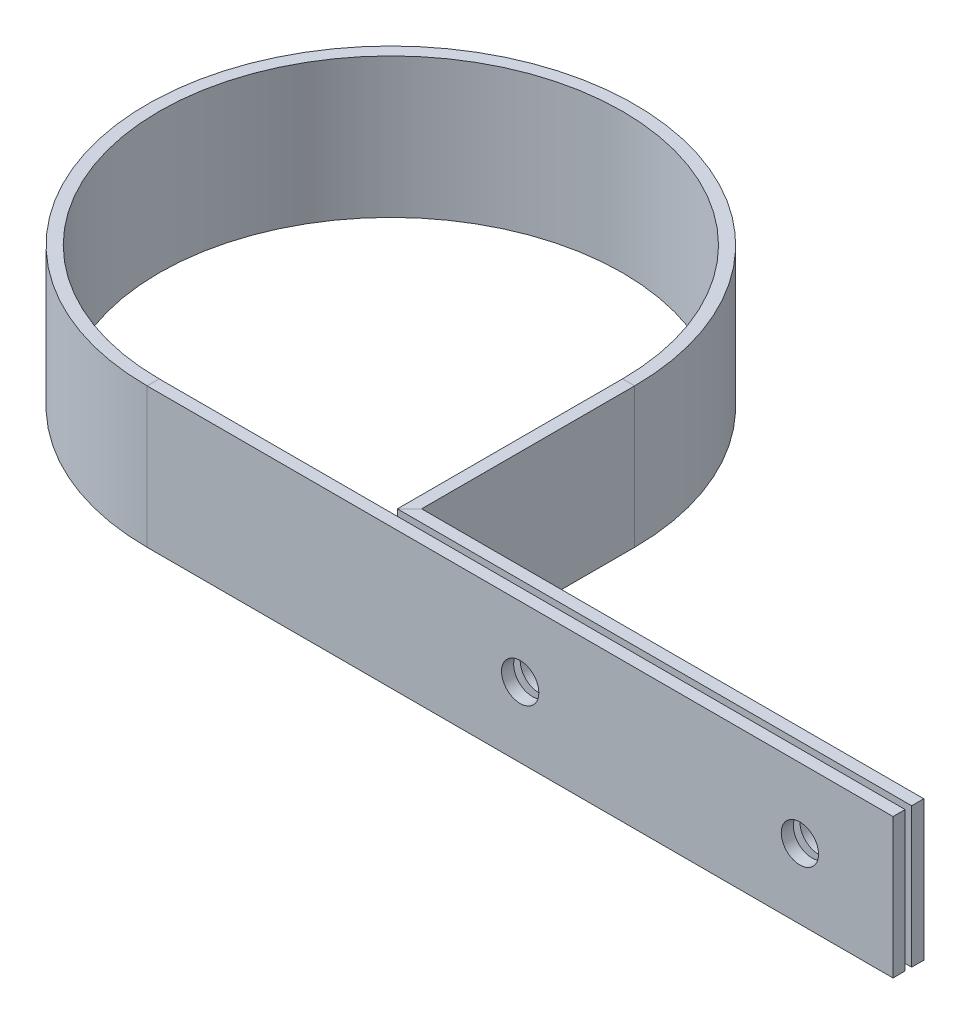
ISO-10303-21;
HEADER;
FILE_DESCRIPTION(('STEP AP214'),'2;1');
FILE_NAME('part.step','',(''),(''),'','','');
FILE_SCHEMA(('AUTOMOTIVE_DESIGN { 1 0 10303 214 1 1 1 1 }'));
ENDSEC;
DATA;
#1=APPLICATION_CONTEXT('core data for automotive mechanical design processes');
#2=APPLICATION_PROTOCOL_DEFINITION('international standard','automotive_design',2000,#1);
#3=PRODUCT_CONTEXT('',#1,'mechanical');
#4=PRODUCT('Part','Part','',(#3));
#5=PRODUCT_RELATED_PRODUCT_CATEGORY('part','',(#4));
#6=PRODUCT_DEFINITION_FORMATION('','',#4);
#7=PRODUCT_DEFINITION_CONTEXT('part definition',#1,'design');
#8=PRODUCT_DEFINITION('design','',#6,#7);
#9=PRODUCT_DEFINITION_SHAPE('','',#8);
#10=(LENGTH_UNIT() NAMED_UNIT(*) SI_UNIT(.MILLI.,.METRE.));
#11=(NAMED_UNIT(*) PLANE_ANGLE_UNIT() SI_UNIT($,.RADIAN.));
#12=(NAMED_UNIT(*) SI_UNIT($,.STERADIAN.) SOLID_ANGLE_UNIT());
#13=UNCERTAINTY_MEASURE_WITH_UNIT(LENGTH_MEASURE(1.E-05),#10,'distance_accuracy_value','');
#14=(GEOMETRIC_REPRESENTATION_CONTEXT(3) GLOBAL_UNCERTAINTY_ASSIGNED_CONTEXT((#13)) GLOBAL_UNIT_ASSIGNED_CONTEXT((#10,
#11,#12)) REPRESENTATION_CONTEXT('',''));
#15=CARTESIAN_POINT('',(0.,0.,0.));
#16=DIRECTION('',(0.,0.,1.));
#17=DIRECTION('',(1.,0.,0.));
#18=AXIS2_PLACEMENT_3D('',#15,#16,#17);
#19=CARTESIAN_POINT('',(0.,0.,0.));
#20=DIRECTION('',(1.,0.,0.));
#21=DIRECTION('',(0.,0.,-1.));
#22=AXIS2_PLACEMENT_3D('',#19,#20,#21);
#23=PLANE('',#22);
#24=DIRECTION('',(0.,-1.,0.));
#25=VECTOR('',#24,1.);
#26=CARTESIAN_POINT('',(0.,-9.525,0.8255));
#27=LINE('',#26,#25);
#28=CARTESIAN_POINT('',(0.,9.525,0.8255));
#29=VERTEX_POINT('',#28);
#30=CARTESIAN_POINT('',(0.,-9.525,0.8255));
#31=VERTEX_POINT('',#30);
#32=EDGE_CURVE('E154',#29,#31,#27,.T.);
#33=ORIENTED_EDGE('',*,*,#32,.T.);
#34=DIRECTION('',(0.,0.,-1.));
#35=VECTOR('',#34,1.);
#36=CARTESIAN_POINT('',(0.,-9.525,-0.8255));
#37=LINE('',#36,#35);
#38=CARTESIAN_POINT('',(0.,-9.525,-0.8255));
#39=VERTEX_POINT('',#38);
#40=EDGE_CURVE('E105',#31,#39,#37,.T.);
#41=ORIENTED_EDGE('',*,*,#40,.T.);
#42=DIRECTION('',(0.,1.,0.));
#43=VECTOR('',#42,1.);
#44=CARTESIAN_POINT('',(0.,-9.525,-0.8255));
#45=LINE('',#44,#43);
#46=CARTESIAN_POINT('',(0.,9.525,-0.8255));
#47=VERTEX_POINT('',#46);
#48=EDGE_CURVE('E117',#39,#47,#45,.T.);
#49=ORIENTED_EDGE('',*,*,#48,.T.);
#50=DIRECTION('',(0.,0.,1.));
#51=VECTOR('',#50,1.);
#52=CARTESIAN_POINT('',(0.,9.525,-0.8255));
#53=LINE('',#52,#51);
#54=EDGE_CURVE('E258',#47,#29,#53,.T.);
#55=ORIENTED_EDGE('',*,*,#54,.T.);
#56=EDGE_LOOP('',(#33,#41,#49,#55));
#57=FACE_BOUND('',#56,.T.);
#58=ADVANCED_FACE('F33',(#57),#23,.T.);
#59=CARTESIAN_POINT('',(0.,0.,-2.53999999999999));
#60=DIRECTION('',(-1.,0.,0.));
#61=DIRECTION('',(0.,0.,1.));
#62=AXIS2_PLACEMENT_3D('',#59,#60,#61);
#63=PLANE('',#62);
#64=DIRECTION('',(0.,-1.,0.));
#65=VECTOR('',#64,1.);
#66=CARTESIAN_POINT('',(0.,-9.525,-3.36549999999999));
#67=LINE('',#66,#65);
#68=CARTESIAN_POINT('',(0.,9.525,-3.36549999999999));
#69=VERTEX_POINT('',#68);
#70=CARTESIAN_POINT('',(0.,-9.525,-3.36549999999999));
#71=VERTEX_POINT('',#70);
#72=EDGE_CURVE('E365',#69,#71,#67,.T.);
#73=ORIENTED_EDGE('',*,*,#72,.F.);
#74=DIRECTION('',(0.,0.,-1.));
#75=VECTOR('',#74,1.);
#76=CARTESIAN_POINT('',(0.,9.525,-1.71449999999999));
#77=LINE('',#76,#75);
#78=CARTESIAN_POINT('',(0.,9.525,-1.71449999999999));
#79=VERTEX_POINT('',#78);
#80=EDGE_CURVE('E384',#79,#69,#77,.T.);
#81=ORIENTED_EDGE('',*,*,#80,.F.);
#82=DIRECTION('',(0.,1.,0.));
#83=VECTOR('',#82,1.);
#84=CARTESIAN_POINT('',(0.,-9.525,-1.71449999999999));
#85=LINE('',#84,#83);
#86=CARTESIAN_POINT('',(0.,-9.525,-1.71449999999999));
#87=VERTEX_POINT('',#86);
#88=EDGE_CURVE('E278',#87,#79,#85,.T.);
#89=ORIENTED_EDGE('',*,*,#88,.F.);
#90=DIRECTION('',(0.,0.,1.));
#91=VECTOR('',#90,1.);
#92=CARTESIAN_POINT('',(0.,-9.525,-1.71449999999999));
#93=LINE('',#92,#91);
#94=EDGE_CURVE('E378',#71,#87,#93,.T.);
#95=ORIENTED_EDGE('',*,*,#94,.F.);
#96=EDGE_LOOP('',(#73,#81,#89,#95));
#97=FACE_BOUND('',#96,.T.);
#98=ADVANCED_FACE('F178',(#97),#63,.F.);
#99=CARTESIAN_POINT('',(-101.6,-9.525,-0.825499999999988));
#100=DIRECTION('',(0.,0.,-1.));
#101=DIRECTION('',(-1.,0.,0.));
#102=AXIS2_PLACEMENT_3D('',#99,#100,#101);
#103=PLANE('',#102);
#104=CARTESIAN_POINT('',(-50.7874392112626,0.,-0.825499999999994));
#105=DIRECTION('',(0.,0.,-1.));
#106=DIRECTION('',(-1.,0.,0.));
#107=AXIS2_PLACEMENT_3D('',#104,#105,#106);
#108=CIRCLE('',#107,2.54);
#109=CARTESIAN_POINT('',(-53.3274392112626,0.,-0.825499999999994));
#110=VERTEX_POINT('',#109);
#111=EDGE_CURVE('E118',#110,#110,#108,.T.);
#112=ORIENTED_EDGE('',*,*,#111,.F.);
#113=EDGE_LOOP('',(#112));
#114=FACE_BOUND('',#113,.T.);
#115=CARTESIAN_POINT('',(-12.6874392112626,0.,-0.825499999999999));
#116=DIRECTION('',(0.,0.,-1.));
#117=DIRECTION('',(-1.,0.,0.));
#118=AXIS2_PLACEMENT_3D('',#115,#116,#117);
#119=CIRCLE('',#118,2.54);
#120=CARTESIAN_POINT('',(-15.2274392112626,0.,-0.825499999999998));
#121=VERTEX_POINT('',#120);
#122=EDGE_CURVE('E402',#121,#121,#119,.T.);
#123=ORIENTED_EDGE('',*,*,#122,.F.);
#124=EDGE_LOOP('',(#123));
#125=FACE_BOUND('',#124,.T.);
#126=DIRECTION('',(1.,0.,0.));
#127=VECTOR('',#126,1.);
#128=CARTESIAN_POINT('',(-101.6,9.525,-0.825499999999988));
#129=LINE('',#128,#127);
#130=CARTESIAN_POINT('',(-101.600137121204,9.525,-0.825499974945539));
#131=VERTEX_POINT('',#130);
#132=EDGE_CURVE('E254',#131,#47,#129,.T.);
#133=ORIENTED_EDGE('',*,*,#132,.T.);
#134=ORIENTED_EDGE('',*,*,#48,.F.);
#135=DIRECTION('',(1.,0.,0.));
#136=VECTOR('',#135,1.);
#137=CARTESIAN_POINT('',(-101.6,-9.525,-0.825499999999988));
#138=LINE('',#137,#136);
#139=CARTESIAN_POINT('',(-101.600137121204,-9.525,-0.825499974945539));
#140=VERTEX_POINT('',#139);
#141=EDGE_CURVE('E96',#140,#39,#138,.T.);
#142=ORIENTED_EDGE('',*,*,#141,.F.);
#143=DIRECTION('',(0.,1.,0.));
#144=VECTOR('',#143,1.);
#145=CARTESIAN_POINT('',(-101.60027424241,-9.525,-0.825499954446444));
#146=LINE('',#145,#144);
#147=EDGE_CURVE('E114',#140,#131,#146,.T.);
#148=ORIENTED_EDGE('',*,*,#147,.T.);
#149=EDGE_LOOP('',(#133,#134,#142,#148));
#150=FACE_BOUND('',#149,.T.);
#151=ADVANCED_FACE('F113',(#114,#125,#150),#103,.T.);
#152=CARTESIAN_POINT('',(-101.6,9.525,-0.825499999999988));
#153=DIRECTION('',(0.,1.,0.));
#154=DIRECTION('',(0.,0.,1.));
#155=AXIS2_PLACEMENT_3D('',#152,#153,#154);
#156=PLANE('',#155);
#157=DIRECTION('',(1.,0.,0.));
#158=VECTOR('',#157,1.);
#159=CARTESIAN_POINT('',(-101.6,9.525,0.825500000000012));
#160=LINE('',#159,#158);
#161=CARTESIAN_POINT('',(-101.599862878796,9.525,0.825499974945562));
#162=VERTEX_POINT('',#161);
#163=EDGE_CURVE('E253',#162,#29,#160,.T.);
#164=ORIENTED_EDGE('',*,*,#163,.T.);
#165=ORIENTED_EDGE('',*,*,#54,.F.);
#166=ORIENTED_EDGE('',*,*,#132,.F.);
#167=DIRECTION('',(0.000332213700346355,0.,0.999999944817027));
#168=VECTOR('',#167,1.);
#169=CARTESIAN_POINT('',(-101.60027424241,9.525,-0.825499954446444));
#170=LINE('',#169,#168);
#171=EDGE_CURVE('E148',#131,#162,#170,.T.);
#172=ORIENTED_EDGE('',*,*,#171,.T.);
#173=EDGE_LOOP('',(#164,#165,#166,#172));
#174=FACE_BOUND('',#173,.T.);
#175=ADVANCED_FACE('F171',(#174),#156,.T.);
#176=CARTESIAN_POINT('',(-101.6,-9.525,0.825500000000012));
#177=DIRECTION('',(0.,0.,1.));
#178=DIRECTION('',(1.,0.,0.));
#179=AXIS2_PLACEMENT_3D('',#176,#177,#178);
#180=PLANE('',#179);
#181=CARTESIAN_POINT('',(-50.7874392112626,0.,0.825500000000006));
#182=DIRECTION('',(0.,0.,1.));
#183=DIRECTION('',(1.,0.,0.));
#184=AXIS2_PLACEMENT_3D('',#181,#182,#183);
#185=CIRCLE('',#184,2.54);
#186=CARTESIAN_POINT('',(-48.2474392112626,0.,0.825500000000006));
#187=VERTEX_POINT('',#186);
#188=EDGE_CURVE('E399',#187,#187,#185,.T.);
#189=ORIENTED_EDGE('',*,*,#188,.F.);
#190=EDGE_LOOP('',(#189));
#191=FACE_BOUND('',#190,.T.);
#192=CARTESIAN_POINT('',(-12.6874392112626,0.,0.825500000000001));
#193=DIRECTION('',(0.,0.,1.));
#194=DIRECTION('',(1.,0.,0.));
#195=AXIS2_PLACEMENT_3D('',#192,#193,#194);
#196=CIRCLE('',#195,2.54);
#197=CARTESIAN_POINT('',(-10.1474392112626,0.,0.825500000000001));
#198=VERTEX_POINT('',#197);
#199=EDGE_CURVE('E405',#198,#198,#196,.T.);
#200=ORIENTED_EDGE('',*,*,#199,.F.);
#201=EDGE_LOOP('',(#200));
#202=FACE_BOUND('',#201,.T.);
#203=DIRECTION('',(1.,0.,0.));
#204=VECTOR('',#203,1.);
#205=CARTESIAN_POINT('',(-101.6,-9.525,0.825500000000012));
#206=LINE('',#205,#204);
#207=CARTESIAN_POINT('',(-101.599862878796,-9.525,0.825499974945562));
#208=VERTEX_POINT('',#207);
#209=EDGE_CURVE('E98',#208,#31,#206,.T.);
#210=ORIENTED_EDGE('',*,*,#209,.T.);
#211=ORIENTED_EDGE('',*,*,#32,.F.);
#212=ORIENTED_EDGE('',*,*,#163,.F.);
#213=DIRECTION('',(0.,-1.,0.));
#214=VECTOR('',#213,1.);
#215=CARTESIAN_POINT('',(-101.59972575759,-9.525,0.825499954446468));
#216=LINE('',#215,#214);
#217=EDGE_CURVE('E222',#162,#208,#216,.T.);
#218=ORIENTED_EDGE('',*,*,#217,.T.);
#219=EDGE_LOOP('',(#210,#211,#212,#218));
#220=FACE_BOUND('',#219,.T.);
#221=ADVANCED_FACE('F161',(#191,#202,#220),#180,.T.);
#222=CARTESIAN_POINT('',(-101.6,-9.525,-0.825499999999988));
#223=DIRECTION('',(0.,-1.,0.));
#224=DIRECTION('',(0.,0.,-1.));
#225=AXIS2_PLACEMENT_3D('',#222,#223,#224);
#226=PLANE('',#225);
#227=ORIENTED_EDGE('',*,*,#40,.F.);
#228=ORIENTED_EDGE('',*,*,#209,.F.);
#229=DIRECTION('',(-0.000332213700346355,0.,-0.999999944817027));
#230=VECTOR('',#229,1.);
#231=CARTESIAN_POINT('',(-101.60027424241,-9.525,-0.825499954446444));
#232=LINE('',#231,#230);
#233=EDGE_CURVE('E91',#208,#140,#232,.T.);
#234=ORIENTED_EDGE('',*,*,#233,.T.);
#235=ORIENTED_EDGE('',*,*,#141,.T.);
#236=EDGE_LOOP('',(#227,#228,#234,#235));
#237=FACE_BOUND('',#236,.T.);
#238=ADVANCED_FACE('F95',(#237),#226,.T.);
#239=CARTESIAN_POINT('',(-70.0512587406857,-9.525,-1.53194999999999));
#240=DIRECTION('',(-1.,0.,0.));
#241=DIRECTION('',(0.,0.,1.));
#242=AXIS2_PLACEMENT_3D('',#239,#240,#241);
#243=PLANE('',#242);
#244=DIRECTION('',(0.,-1.,0.));
#245=VECTOR('',#244,1.);
#246=CARTESIAN_POINT('',(-70.0512587406857,-9.525,-1.71449999999999));
#247=LINE('',#246,#245);
#248=CARTESIAN_POINT('',(-70.0512587406857,9.525,-1.71449999999999));
#249=VERTEX_POINT('',#248);
#250=CARTESIAN_POINT('',(-70.0512587406857,-9.525,-1.71449999999999));
#251=VERTEX_POINT('',#250);
#252=EDGE_CURVE('E368',#249,#251,#247,.T.);
#253=ORIENTED_EDGE('',*,*,#252,.F.);
#254=DIRECTION('',(0.,0.,-1.));
#255=VECTOR('',#254,1.);
#256=CARTESIAN_POINT('',(-70.0512587406857,9.525,-1.53194999999999));
#257=LINE('',#256,#255);
#258=CARTESIAN_POINT('',(-70.0512587406857,9.525,-32.3849982128994));
#259=VERTEX_POINT('',#258);
#260=EDGE_CURVE('E274',#249,#259,#257,.T.);
#261=ORIENTED_EDGE('',*,*,#260,.T.);
#262=DIRECTION('',(0.,1.,0.));
#263=VECTOR('',#262,1.);
#264=CARTESIAN_POINT('',(-70.0512587406857,-9.525,-32.3849982128994));
#265=LINE('',#264,#263);
#266=CARTESIAN_POINT('',(-70.0512587406857,-9.525,-32.3849982128994));
#267=VERTEX_POINT('',#266);
#268=EDGE_CURVE('E268',#267,#259,#265,.T.);
#269=ORIENTED_EDGE('',*,*,#268,.F.);
#270=DIRECTION('',(0.,0.,-1.));
#271=VECTOR('',#270,1.);
#272=CARTESIAN_POINT('',(-70.0512587406857,-9.525,-1.53194999999999));
#273=LINE('',#272,#271);
#274=EDGE_CURVE('E276',#251,#267,#273,.T.);
#275=ORIENTED_EDGE('',*,*,#274,.F.);
#276=EDGE_LOOP('',(#253,#261,#269,#275));
#277=FACE_BOUND('',#276,.T.);
#278=ADVANCED_FACE('F177',(#277),#243,.T.);
#279=CARTESIAN_POINT('',(-70.0512587406857,9.525,-1.53194999999999));
#280=DIRECTION('',(0.,1.,0.));
#281=DIRECTION('',(0.,0.,1.));
#282=AXIS2_PLACEMENT_3D('',#279,#280,#281);
#283=PLANE('',#282);
#284=DIRECTION('',(-0.707106781186547,0.,0.707106781186548));
#285=VECTOR('',#284,1.);
#286=CARTESIAN_POINT('',(-35.0256293703429,9.525,-36.7401293703428));
#287=LINE('',#286,#285);
#288=CARTESIAN_POINT('',(-68.4002587406857,9.525,-3.36549999999999));
#289=VERTEX_POINT('',#288);
#290=EDGE_CURVE('E11',#289,#249,#287,.T.);
#291=ORIENTED_EDGE('',*,*,#290,.F.);
#292=DIRECTION('',(0.,0.,-1.));
#293=VECTOR('',#292,1.);
#294=CARTESIAN_POINT('',(-68.4002587406857,9.525,-1.53194999999999));
#295=LINE('',#294,#293);
#296=CARTESIAN_POINT('',(-68.4002587406857,9.525,-32.3849982128994));
#297=VERTEX_POINT('',#296);
#298=EDGE_CURVE('E262',#289,#297,#295,.T.);
#299=ORIENTED_EDGE('',*,*,#298,.T.);
#300=DIRECTION('',(1.,0.,0.));
#301=VECTOR('',#300,1.);
#302=CARTESIAN_POINT('',(-70.0512587406857,9.525,-32.3849982128994));
#303=LINE('',#302,#301);
#304=EDGE_CURVE('E266',#259,#297,#303,.T.);
#305=ORIENTED_EDGE('',*,*,#304,.F.);
#306=ORIENTED_EDGE('',*,*,#260,.F.);
#307=EDGE_LOOP('',(#291,#299,#305,#306));
#308=FACE_BOUND('',#307,.T.);
#309=ADVANCED_FACE('F306',(#308),#283,.T.);
#310=CARTESIAN_POINT('',(-68.4002587406857,-9.525,-1.53194999999999));
#311=DIRECTION('',(1.,0.,0.));
#312=DIRECTION('',(0.,0.,-1.));
#313=AXIS2_PLACEMENT_3D('',#310,#311,#312);
#314=PLANE('',#313);
#315=DIRECTION('',(0.,1.,0.));
#316=VECTOR('',#315,1.);
#317=CARTESIAN_POINT('',(-68.4002587406857,-9.525,-3.36549999999999));
#318=LINE('',#317,#316);
#319=CARTESIAN_POINT('',(-68.4002587406857,-9.525,-3.36549999999999));
#320=VERTEX_POINT('',#319);
#321=EDGE_CURVE('E42',#320,#289,#318,.T.);
#322=ORIENTED_EDGE('',*,*,#321,.F.);
#323=DIRECTION('',(0.,0.,-1.));
#324=VECTOR('',#323,1.);
#325=CARTESIAN_POINT('',(-68.4002587406857,-9.525,-1.53194999999999));
#326=LINE('',#325,#324);
#327=CARTESIAN_POINT('',(-68.4002587406857,-9.525,-32.3849982128994));
#328=VERTEX_POINT('',#327);
#329=EDGE_CURVE('E265',#320,#328,#326,.T.);
#330=ORIENTED_EDGE('',*,*,#329,.T.);
#331=DIRECTION('',(0.,-1.,0.));
#332=VECTOR('',#331,1.);
#333=CARTESIAN_POINT('',(-68.4002587406857,-9.525,-32.3849982128994));
#334=LINE('',#333,#332);
#335=EDGE_CURVE('E138',#297,#328,#334,.T.);
#336=ORIENTED_EDGE('',*,*,#335,.F.);
#337=ORIENTED_EDGE('',*,*,#298,.F.);
#338=EDGE_LOOP('',(#322,#330,#336,#337));
#339=FACE_BOUND('',#338,.T.);
#340=ADVANCED_FACE('F261',(#339),#314,.T.);
#341=CARTESIAN_POINT('',(-70.0512587406857,-9.525,-1.53194999999999));
#342=DIRECTION('',(0.,-1.,0.));
#343=DIRECTION('',(0.,0.,-1.));
#344=AXIS2_PLACEMENT_3D('',#341,#342,#343);
#345=PLANE('',#344);
#346=DIRECTION('',(0.707106781186547,0.,-0.707106781186548));
#347=VECTOR('',#346,1.);
#348=CARTESIAN_POINT('',(-35.0256293703429,-9.525,-36.7401293703428));
#349=LINE('',#348,#347);
#350=EDGE_CURVE('E372',#251,#320,#349,.T.);
#351=ORIENTED_EDGE('',*,*,#350,.F.);
#352=ORIENTED_EDGE('',*,*,#274,.T.);
#353=DIRECTION('',(-1.,0.,0.));
#354=VECTOR('',#353,1.);
#355=CARTESIAN_POINT('',(-70.0512587406857,-9.525,-32.3849982128994));
#356=LINE('',#355,#354);
#357=EDGE_CURVE('E135',#328,#267,#356,.T.);
#358=ORIENTED_EDGE('',*,*,#357,.F.);
#359=ORIENTED_EDGE('',*,*,#329,.F.);
#360=EDGE_LOOP('',(#351,#352,#358,#359));
#361=FACE_BOUND('',#360,.T.);
#362=ADVANCED_FACE('F300',(#361),#345,.T.);
#363=CARTESIAN_POINT('',(-101.610758740686,0.,-32.3849982128994));
#364=DIRECTION('',(0.,1.,0.));
#365=DIRECTION('',(0.,0.,1.));
#366=AXIS2_PLACEMENT_3D('',#363,#364,#365);
#367=CYLINDRICAL_SURFACE('',#366,31.5595);
#368=CARTESIAN_POINT('',(-101.610758740686,9.525,-32.3849982128994));
#369=DIRECTION('',(0.,1.,0.));
#370=DIRECTION('',(1.,0.,0.));
#371=AXIS2_PLACEMENT_3D('',#368,#369,#370);
#372=CIRCLE('',#371,31.5595);
#373=EDGE_CURVE('E129',#259,#131,#372,.T.);
#374=ORIENTED_EDGE('',*,*,#373,.T.);
#375=ORIENTED_EDGE('',*,*,#147,.F.);
#376=CARTESIAN_POINT('',(-101.610758740686,-9.525,-32.3849982128994));
#377=DIRECTION('',(0.,1.,0.));
#378=DIRECTION('',(1.,0.,0.));
#379=AXIS2_PLACEMENT_3D('',#376,#377,#378);
#380=CIRCLE('',#379,31.5595);
#381=EDGE_CURVE('E126',#267,#140,#380,.T.);
#382=ORIENTED_EDGE('',*,*,#381,.F.);
#383=ORIENTED_EDGE('',*,*,#268,.T.);
#384=EDGE_LOOP('',(#374,#375,#382,#383));
#385=FACE_BOUND('',#384,.T.);
#386=ADVANCED_FACE('F124',(#385),#367,.F.);
#387=CARTESIAN_POINT('',(-70.0512587406857,9.525,-32.3849982128994));
#388=DIRECTION('',(0.,1.,0.));
#389=DIRECTION('',(0.,0.,1.));
#390=AXIS2_PLACEMENT_3D('',#387,#388,#389);
#391=PLANE('',#390);
#392=CARTESIAN_POINT('',(-101.610758740686,9.525,-32.3849982128994));
#393=DIRECTION('',(0.,1.,0.));
#394=DIRECTION('',(1.,0.,0.));
#395=AXIS2_PLACEMENT_3D('',#392,#393,#394);
#396=CIRCLE('',#395,33.2105);
#397=EDGE_CURVE('E150',#297,#162,#396,.T.);
#398=ORIENTED_EDGE('',*,*,#397,.T.);
#399=ORIENTED_EDGE('',*,*,#171,.F.);
#400=ORIENTED_EDGE('',*,*,#373,.F.);
#401=ORIENTED_EDGE('',*,*,#304,.T.);
#402=EDGE_LOOP('',(#398,#399,#400,#401));
#403=FACE_BOUND('',#402,.T.);
#404=ADVANCED_FACE('F206',(#403),#391,.T.);
#405=CARTESIAN_POINT('',(-101.610758740686,0.,-32.3849982128994));
#406=DIRECTION('',(0.,1.,0.));
#407=DIRECTION('',(0.,0.,1.));
#408=AXIS2_PLACEMENT_3D('',#405,#406,#407);
#409=CYLINDRICAL_SURFACE('',#408,33.2105);
#410=CARTESIAN_POINT('',(-101.610758740686,-9.525,-32.3849982128994));
#411=DIRECTION('',(0.,1.,0.));
#412=DIRECTION('',(1.,0.,0.));
#413=AXIS2_PLACEMENT_3D('',#410,#411,#412);
#414=CIRCLE('',#413,33.2105);
#415=EDGE_CURVE('E104',#328,#208,#414,.T.);
#416=ORIENTED_EDGE('',*,*,#415,.T.);
#417=ORIENTED_EDGE('',*,*,#217,.F.);
#418=ORIENTED_EDGE('',*,*,#397,.F.);
#419=ORIENTED_EDGE('',*,*,#335,.T.);
#420=EDGE_LOOP('',(#416,#417,#418,#419));
#421=FACE_BOUND('',#420,.T.);
#422=ADVANCED_FACE('F201',(#421),#409,.T.);
#423=CARTESIAN_POINT('',(-70.0512587406857,-9.525,-32.3849982128994));
#424=DIRECTION('',(0.,-1.,0.));
#425=DIRECTION('',(0.,0.,-1.));
#426=AXIS2_PLACEMENT_3D('',#423,#424,#425);
#427=PLANE('',#426);
#428=ORIENTED_EDGE('',*,*,#233,.F.);
#429=ORIENTED_EDGE('',*,*,#415,.F.);
#430=ORIENTED_EDGE('',*,*,#357,.T.);
#431=ORIENTED_EDGE('',*,*,#381,.T.);
#432=EDGE_LOOP('',(#428,#429,#430,#431));
#433=FACE_BOUND('',#432,.T.);
#434=ADVANCED_FACE('F133',(#433),#427,.T.);
#435=CARTESIAN_POINT('',(0.,-9.525,-1.71449999999999));
#436=DIRECTION('',(0.,-1.,0.));
#437=DIRECTION('',(0.,0.,-1.));
#438=AXIS2_PLACEMENT_3D('',#435,#436,#437);
#439=PLANE('',#438);
#440=DIRECTION('',(-1.,0.,0.));
#441=VECTOR('',#440,1.);
#442=CARTESIAN_POINT('',(0.,-9.525,-1.71449999999999));
#443=LINE('',#442,#441);
#444=EDGE_CURVE('E379',#87,#251,#443,.T.);
#445=ORIENTED_EDGE('',*,*,#444,.T.);
#446=ORIENTED_EDGE('',*,*,#350,.T.);
#447=DIRECTION('',(-1.,0.,0.));
#448=VECTOR('',#447,1.);
#449=CARTESIAN_POINT('',(0.,-9.525,-3.36549999999999));
#450=LINE('',#449,#448);
#451=EDGE_CURVE('E360',#71,#320,#450,.T.);
#452=ORIENTED_EDGE('',*,*,#451,.F.);
#453=ORIENTED_EDGE('',*,*,#94,.T.);
#454=EDGE_LOOP('',(#445,#446,#452,#453));
#455=FACE_BOUND('',#454,.T.);
#456=ADVANCED_FACE('F200',(#455),#439,.T.);
#457=CARTESIAN_POINT('',(0.,-9.525,-3.36549999999999));
#458=DIRECTION('',(0.,0.,-1.));
#459=DIRECTION('',(-1.,0.,0.));
#460=AXIS2_PLACEMENT_3D('',#457,#458,#459);
#461=PLANE('',#460);
#462=CARTESIAN_POINT('',(-50.7874392112626,0.,-3.36549999999999));
#463=DIRECTION('',(0.,0.,-1.));
#464=DIRECTION('',(-1.,0.,0.));
#465=AXIS2_PLACEMENT_3D('',#462,#463,#464);
#466=CIRCLE('',#465,2.54);
#467=CARTESIAN_POINT('',(-53.3274392112626,0.,-3.36549999999999));
#468=VERTEX_POINT('',#467);
#469=EDGE_CURVE('E352',#468,#468,#466,.T.);
#470=ORIENTED_EDGE('',*,*,#469,.F.);
#471=EDGE_LOOP('',(#470));
#472=FACE_BOUND('',#471,.T.);
#473=CARTESIAN_POINT('',(-12.6874392112626,0.,-3.36549999999999));
#474=DIRECTION('',(0.,0.,-1.));
#475=DIRECTION('',(-1.,0.,0.));
#476=AXIS2_PLACEMENT_3D('',#473,#474,#475);
#477=CIRCLE('',#476,2.54);
#478=CARTESIAN_POINT('',(-15.2274392112626,0.,-3.36549999999999));
#479=VERTEX_POINT('',#478);
#480=EDGE_CURVE('E356',#479,#479,#477,.T.);
#481=ORIENTED_EDGE('',*,*,#480,.F.);
#482=EDGE_LOOP('',(#481));
#483=FACE_BOUND('',#482,.T.);
#484=ORIENTED_EDGE('',*,*,#451,.T.);
#485=ORIENTED_EDGE('',*,*,#321,.T.);
#486=DIRECTION('',(-1.,0.,0.));
#487=VECTOR('',#486,1.);
#488=CARTESIAN_POINT('',(0.,9.525,-3.36549999999999));
#489=LINE('',#488,#487);
#490=EDGE_CURVE('E369',#69,#289,#489,.T.);
#491=ORIENTED_EDGE('',*,*,#490,.F.);
#492=ORIENTED_EDGE('',*,*,#72,.T.);
#493=EDGE_LOOP('',(#484,#485,#491,#492));
#494=FACE_BOUND('',#493,.T.);
#495=ADVANCED_FACE('F337',(#472,#483,#494),#461,.T.);
#496=CARTESIAN_POINT('',(0.,9.525,-1.71449999999999));
#497=DIRECTION('',(0.,1.,0.));
#498=DIRECTION('',(0.,0.,1.));
#499=AXIS2_PLACEMENT_3D('',#496,#497,#498);
#500=PLANE('',#499);
#501=ORIENTED_EDGE('',*,*,#490,.T.);
#502=ORIENTED_EDGE('',*,*,#290,.T.);
#503=DIRECTION('',(-1.,0.,0.));
#504=VECTOR('',#503,1.);
#505=CARTESIAN_POINT('',(0.,9.525,-1.71449999999999));
#506=LINE('',#505,#504);
#507=EDGE_CURVE('E374',#79,#249,#506,.T.);
#508=ORIENTED_EDGE('',*,*,#507,.F.);
#509=ORIENTED_EDGE('',*,*,#80,.T.);
#510=EDGE_LOOP('',(#501,#502,#508,#509));
#511=FACE_BOUND('',#510,.T.);
#512=ADVANCED_FACE('F326',(#511),#500,.T.);
#513=CARTESIAN_POINT('',(0.,-9.525,-1.71449999999999));
#514=DIRECTION('',(0.,0.,1.));
#515=DIRECTION('',(1.,0.,0.));
#516=AXIS2_PLACEMENT_3D('',#513,#514,#515);
#517=PLANE('',#516);
#518=CARTESIAN_POINT('',(-50.7874392112626,0.,-1.71449999999999));
#519=DIRECTION('',(0.,0.,1.));
#520=DIRECTION('',(1.,0.,0.));
#521=AXIS2_PLACEMENT_3D('',#518,#519,#520);
#522=CIRCLE('',#521,2.54);
#523=CARTESIAN_POINT('',(-48.2474392112626,0.,-1.71449999999999));
#524=VERTEX_POINT('',#523);
#525=EDGE_CURVE('E36',#524,#524,#522,.T.);
#526=ORIENTED_EDGE('',*,*,#525,.F.);
#527=EDGE_LOOP('',(#526));
#528=FACE_BOUND('',#527,.T.);
#529=CARTESIAN_POINT('',(-12.6874392112626,0.,-1.71449999999999));
#530=DIRECTION('',(0.,0.,1.));
#531=DIRECTION('',(1.,0.,0.));
#532=AXIS2_PLACEMENT_3D('',#529,#530,#531);
#533=CIRCLE('',#532,2.54);
#534=CARTESIAN_POINT('',(-10.1474392112626,0.,-1.71449999999999));
#535=VERTEX_POINT('',#534);
#536=EDGE_CURVE('E408',#535,#535,#533,.T.);
#537=ORIENTED_EDGE('',*,*,#536,.F.);
#538=EDGE_LOOP('',(#537));
#539=FACE_BOUND('',#538,.T.);
#540=ORIENTED_EDGE('',*,*,#507,.T.);
#541=ORIENTED_EDGE('',*,*,#252,.T.);
#542=ORIENTED_EDGE('',*,*,#444,.F.);
#543=ORIENTED_EDGE('',*,*,#88,.T.);
#544=EDGE_LOOP('',(#540,#541,#542,#543));
#545=FACE_BOUND('',#544,.T.);
#546=ADVANCED_FACE('F323',(#528,#539,#545),#517,.T.);
#547=CARTESIAN_POINT('',(-12.6874392112626,0.,0.827701719149693));
#548=DIRECTION('',(0.,0.,-1.));
#549=DIRECTION('',(-1.,0.,0.));
#550=AXIS2_PLACEMENT_3D('',#547,#548,#549);
#551=CYLINDRICAL_SURFACE('',#550,2.54);
#552=ORIENTED_EDGE('',*,*,#536,.T.);
#553=EDGE_LOOP('',(#552));
#554=FACE_BOUND('',#553,.T.);
#555=ORIENTED_EDGE('',*,*,#480,.T.);
#556=EDGE_LOOP('',(#555));
#557=FACE_BOUND('',#556,.T.);
#558=ADVANCED_FACE('F325',(#554,#557),#551,.F.);
#559=CARTESIAN_POINT('',(-50.7874392112626,0.,0.827701719149698));
#560=DIRECTION('',(0.,0.,-1.));
#561=DIRECTION('',(-1.,0.,0.));
#562=AXIS2_PLACEMENT_3D('',#559,#560,#561);
#563=CYLINDRICAL_SURFACE('',#562,2.54);
#564=ORIENTED_EDGE('',*,*,#525,.T.);
#565=EDGE_LOOP('',(#564));
#566=FACE_BOUND('',#565,.T.);
#567=ORIENTED_EDGE('',*,*,#469,.T.);
#568=EDGE_LOOP('',(#567));
#569=FACE_BOUND('',#568,.T.);
#570=ADVANCED_FACE('F333',(#566,#569),#563,.F.);
#571=ORIENTED_EDGE('',*,*,#122,.T.);
#572=EDGE_LOOP('',(#571));
#573=FACE_BOUND('',#572,.T.);
#574=ORIENTED_EDGE('',*,*,#199,.T.);
#575=EDGE_LOOP('',(#574));
#576=FACE_BOUND('',#575,.T.);
#577=ADVANCED_FACE('F336',(#573,#576),#551,.F.);
#578=ORIENTED_EDGE('',*,*,#111,.T.);
#579=EDGE_LOOP('',(#578));
#580=FACE_BOUND('',#579,.T.);
#581=ORIENTED_EDGE('',*,*,#188,.T.);
#582=EDGE_LOOP('',(#581));
#583=FACE_BOUND('',#582,.T.);
#584=ADVANCED_FACE('F544',(#580,#583),#563,.F.);
#585=CLOSED_SHELL('',(#58,#98,#151,#175,#221,#238,#278,#309,#340,#362,#386,#404,#422,#434,#456,
#495,#512,#546,#558,#570,#577,#584));
#586=MANIFOLD_SOLID_BREP('B2',#585);
#587=ADVANCED_BREP_SHAPE_REPRESENTATION('',(#18,#586),#14);
#588=SHAPE_DEFINITION_REPRESENTATION(#9,#587);
ENDSEC;
END-ISO-10303-21;
